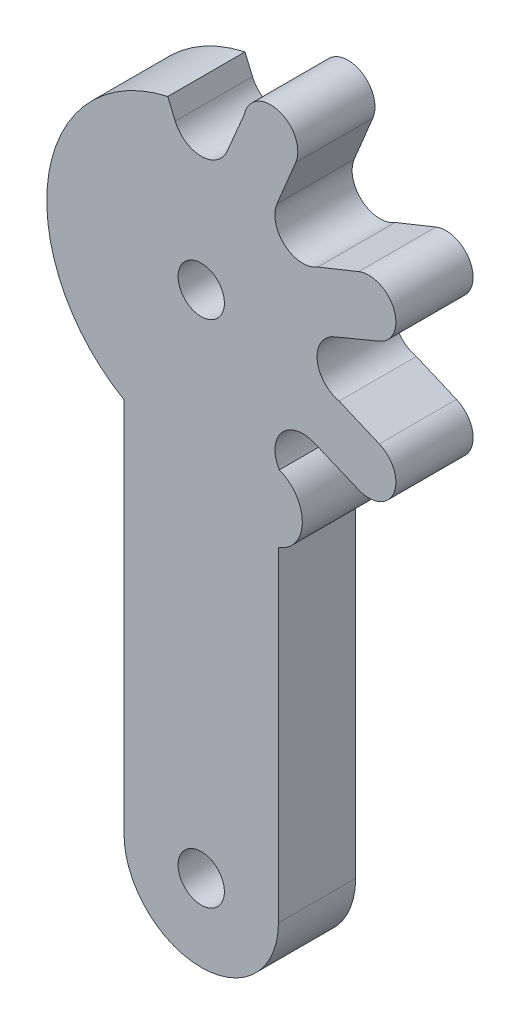
ISO-10303-21;
HEADER;
FILE_DESCRIPTION(('STEP AP214'),'2;1');
FILE_NAME('part.step','',(''),(''),'','','');
FILE_SCHEMA(('AUTOMOTIVE_DESIGN { 1 0 10303 214 1 1 1 1 }'));
ENDSEC;
DATA;
#1=APPLICATION_CONTEXT('core data for automotive mechanical design processes');
#2=APPLICATION_PROTOCOL_DEFINITION('international standard','automotive_design',2000,#1);
#3=PRODUCT_CONTEXT('',#1,'mechanical');
#4=PRODUCT('Part','Part','',(#3));
#5=PRODUCT_RELATED_PRODUCT_CATEGORY('part','',(#4));
#6=PRODUCT_DEFINITION_FORMATION('','',#4);
#7=PRODUCT_DEFINITION_CONTEXT('part definition',#1,'design');
#8=PRODUCT_DEFINITION('design','',#6,#7);
#9=PRODUCT_DEFINITION_SHAPE('','',#8);
#10=(LENGTH_UNIT() NAMED_UNIT(*) SI_UNIT(.MILLI.,.METRE.));
#11=(NAMED_UNIT(*) PLANE_ANGLE_UNIT() SI_UNIT($,.RADIAN.));
#12=(NAMED_UNIT(*) SI_UNIT($,.STERADIAN.) SOLID_ANGLE_UNIT());
#13=UNCERTAINTY_MEASURE_WITH_UNIT(LENGTH_MEASURE(1.E-05),#10,'distance_accuracy_value','');
#14=(GEOMETRIC_REPRESENTATION_CONTEXT(3) GLOBAL_UNCERTAINTY_ASSIGNED_CONTEXT((#13)) GLOBAL_UNIT_ASSIGNED_CONTEXT((#10,
#11,#12)) REPRESENTATION_CONTEXT('',''));
#15=CARTESIAN_POINT('',(0.,0.,0.));
#16=DIRECTION('',(0.,0.,1.));
#17=DIRECTION('',(1.,0.,0.));
#18=AXIS2_PLACEMENT_3D('',#15,#16,#17);
#19=CARTESIAN_POINT('',(4.99970649552399,4.44677047828112E-05,5.));
#20=DIRECTION('',(0.999999999960448,8.89406304567324E-06,0.));
#21=DIRECTION('',(-8.89406304567324E-06,0.999999999960448,0.));
#22=AXIS2_PLACEMENT_3D('',#19,#20,#21);
#23=PLANE('',#22);
#24=DIRECTION('',(8.89406304567324E-06,-0.999999999960448,0.));
#25=VECTOR('',#24,1.);
#26=CARTESIAN_POINT('',(4.99970649552399,4.44677047828112E-05,0.));
#27=LINE('',#26,#25);
#28=CARTESIAN_POINT('',(4.99981272260186,-11.9435495145082,0.));
#29=VERTEX_POINT('',#28);
#30=CARTESIAN_POINT('',(5.,-32.9999999990811,0.));
#31=VERTEX_POINT('',#30);
#32=EDGE_CURVE('E204',#29,#31,#27,.T.);
#33=ORIENTED_EDGE('',*,*,#32,.F.);
#34=DIRECTION('',(0.,0.,-1.));
#35=VECTOR('',#34,1.);
#36=CARTESIAN_POINT('',(4.99981272260186,-11.9435495145082,5.));
#37=LINE('',#36,#35);
#38=CARTESIAN_POINT('',(4.99981272260186,-11.9435495145082,5.));
#39=VERTEX_POINT('',#38);
#40=EDGE_CURVE('E11',#39,#29,#37,.T.);
#41=ORIENTED_EDGE('',*,*,#40,.F.);
#42=DIRECTION('',(8.89406304567324E-06,-0.999999999960448,0.));
#43=VECTOR('',#42,1.);
#44=CARTESIAN_POINT('',(4.99970649552399,4.44677047828112E-05,5.));
#45=LINE('',#44,#43);
#46=CARTESIAN_POINT('',(5.,-32.9999999990811,5.));
#47=VERTEX_POINT('',#46);
#48=EDGE_CURVE('E579',#39,#47,#45,.T.);
#49=ORIENTED_EDGE('',*,*,#48,.T.);
#50=DIRECTION('',(0.,0.,-1.));
#51=VECTOR('',#50,1.);
#52=CARTESIAN_POINT('',(5.,-32.9999999990811,5.));
#53=LINE('',#52,#51);
#54=EDGE_CURVE('E119',#47,#31,#53,.T.);
#55=ORIENTED_EDGE('',*,*,#54,.T.);
#56=EDGE_LOOP('',(#33,#41,#49,#55));
#57=FACE_BOUND('',#56,.T.);
#58=ADVANCED_FACE('F34',(#57),#23,.T.);
#59=CARTESIAN_POINT('',(4.20698218271208,-9.74206172722626,5.));
#60=DIRECTION('',(0.,0.,-1.));
#61=DIRECTION('',(-1.,0.,0.));
#62=AXIS2_PLACEMENT_3D('',#59,#60,#61);
#63=CYLINDRICAL_SURFACE('',#62,2.33989930179343);
#64=CARTESIAN_POINT('',(4.20698218271208,-9.74206172722626,0.));
#65=DIRECTION('',(0.,0.,1.));
#66=DIRECTION('',(1.,0.,0.));
#67=AXIS2_PLACEMENT_3D('',#64,#65,#66);
#68=CIRCLE('',#67,2.33989930179343);
#69=CARTESIAN_POINT('',(5.06067248823431,-7.56345171054344,0.));
#70=VERTEX_POINT('',#69);
#71=EDGE_CURVE('E206',#29,#70,#68,.T.);
#72=ORIENTED_EDGE('',*,*,#71,.T.);
#73=DIRECTION('',(0.,0.,-1.));
#74=VECTOR('',#73,1.);
#75=CARTESIAN_POINT('',(5.06067248823431,-7.56345171054344,5.));
#76=LINE('',#75,#74);
#77=CARTESIAN_POINT('',(5.06067248823431,-7.56345171054344,5.));
#78=VERTEX_POINT('',#77);
#79=EDGE_CURVE('E43',#78,#70,#76,.T.);
#80=ORIENTED_EDGE('',*,*,#79,.F.);
#81=CARTESIAN_POINT('',(4.20698218271208,-9.74206172722626,5.));
#82=DIRECTION('',(0.,0.,1.));
#83=DIRECTION('',(1.,0.,0.));
#84=AXIS2_PLACEMENT_3D('',#81,#82,#83);
#85=CIRCLE('',#84,2.33989930179343);
#86=EDGE_CURVE('E577',#39,#78,#85,.T.);
#87=ORIENTED_EDGE('',*,*,#86,.F.);
#88=ORIENTED_EDGE('',*,*,#40,.T.);
#89=EDGE_LOOP('',(#72,#80,#87,#88));
#90=FACE_BOUND('',#89,.T.);
#91=ADVANCED_FACE('F296',(#90),#63,.T.);
#92=CARTESIAN_POINT('',(6.58824723791817,-6.58419019165335,5.));
#93=DIRECTION('',(0.,0.,-1.));
#94=DIRECTION('',(-1.,0.,0.));
#95=AXIS2_PLACEMENT_3D('',#92,#93,#94);
#96=CYLINDRICAL_SURFACE('',#95,1.81450757459169);
#97=CARTESIAN_POINT('',(6.58824723791817,-6.58419019165335,0.));
#98=DIRECTION('',(0.,0.,1.));
#99=DIRECTION('',(1.,0.,0.));
#100=AXIS2_PLACEMENT_3D('',#97,#98,#99);
#101=CIRCLE('',#100,1.81450757459169);
#102=CARTESIAN_POINT('',(7.28281649303357,-4.90788136327504,0.));
#103=VERTEX_POINT('',#102);
#104=EDGE_CURVE('E209',#70,#103,#101,.F.);
#105=ORIENTED_EDGE('',*,*,#104,.T.);
#106=DIRECTION('',(0.,0.,-1.));
#107=VECTOR('',#106,1.);
#108=CARTESIAN_POINT('',(7.28281649303357,-4.90788136327504,5.));
#109=LINE('',#108,#107);
#110=CARTESIAN_POINT('',(7.28281649303357,-4.90788136327504,5.));
#111=VERTEX_POINT('',#110);
#112=EDGE_CURVE('E286',#111,#103,#109,.T.);
#113=ORIENTED_EDGE('',*,*,#112,.F.);
#114=CARTESIAN_POINT('',(6.58824723791817,-6.58419019165335,5.));
#115=DIRECTION('',(0.,0.,1.));
#116=DIRECTION('',(1.,0.,0.));
#117=AXIS2_PLACEMENT_3D('',#114,#115,#116);
#118=CIRCLE('',#117,1.81450757459169);
#119=EDGE_CURVE('E292',#78,#111,#118,.F.);
#120=ORIENTED_EDGE('',*,*,#119,.F.);
#121=ORIENTED_EDGE('',*,*,#79,.T.);
#122=EDGE_LOOP('',(#105,#113,#120,#121));
#123=FACE_BOUND('',#122,.T.);
#124=ADVANCED_FACE('F290',(#123),#96,.F.);
#125=CARTESIAN_POINT('',(-0.668654314279278,-1.61427431407232,5.));
#126=DIRECTION('',(-0.38268343236509,-0.923879532511287,0.));
#127=DIRECTION('',(0.923879532511287,-0.38268343236509,0.));
#128=AXIS2_PLACEMENT_3D('',#125,#126,#127);
#129=PLANE('',#128);
#130=DIRECTION('',(-0.923879532511287,0.38268343236509,0.));
#131=VECTOR('',#130,1.);
#132=CARTESIAN_POINT('',(-0.668654314279278,-1.61427431407232,0.));
#133=LINE('',#132,#131);
#134=CARTESIAN_POINT('',(10.1869299011087,-6.11080452356931,0.));
#135=VERTEX_POINT('',#134);
#136=EDGE_CURVE('E212',#135,#103,#133,.T.);
#137=ORIENTED_EDGE('',*,*,#136,.F.);
#138=DIRECTION('',(0.,0.,-1.));
#139=VECTOR('',#138,1.);
#140=CARTESIAN_POINT('',(10.1869299011087,-6.11080452356931,5.));
#141=LINE('',#140,#139);
#142=CARTESIAN_POINT('',(10.1869299011087,-6.11080452356931,5.));
#143=VERTEX_POINT('',#142);
#144=EDGE_CURVE('E284',#143,#135,#141,.T.);
#145=ORIENTED_EDGE('',*,*,#144,.F.);
#146=DIRECTION('',(-0.923879532511287,0.38268343236509,0.));
#147=VECTOR('',#146,1.);
#148=CARTESIAN_POINT('',(-0.668654314279278,-1.61427431407232,5.));
#149=LINE('',#148,#147);
#150=EDGE_CURVE('E530',#143,#111,#149,.T.);
#151=ORIENTED_EDGE('',*,*,#150,.T.);
#152=ORIENTED_EDGE('',*,*,#112,.T.);
#153=EDGE_LOOP('',(#137,#145,#151,#152));
#154=FACE_BOUND('',#153,.T.);
#155=ADVANCED_FACE('F382',(#154),#129,.T.);
#156=CARTESIAN_POINT('',(10.856438621682,-4.49393779066091,5.));
#157=DIRECTION('',(0.,0.,-1.));
#158=DIRECTION('',(-1.,0.,0.));
#159=AXIS2_PLACEMENT_3D('',#156,#157,#158);
#160=CYLINDRICAL_SURFACE('',#159,1.74999998825991);
#161=CARTESIAN_POINT('',(10.856438621682,-4.49393779066091,0.));
#162=DIRECTION('',(0.,0.,1.));
#163=DIRECTION('',(1.,0.,0.));
#164=AXIS2_PLACEMENT_3D('',#161,#162,#163);
#165=CIRCLE('',#164,1.74999998825991);
#166=CARTESIAN_POINT('',(11.5259473419372,-2.87707105762073,0.));
#167=VERTEX_POINT('',#166);
#168=EDGE_CURVE('E215',#167,#135,#165,.F.);
#169=ORIENTED_EDGE('',*,*,#168,.F.);
#170=DIRECTION('',(0.,0.,-1.));
#171=VECTOR('',#170,1.);
#172=CARTESIAN_POINT('',(11.5259473419372,-2.87707105762073,5.));
#173=LINE('',#172,#171);
#174=CARTESIAN_POINT('',(11.5259473419372,-2.87707105762073,5.));
#175=VERTEX_POINT('',#174);
#176=EDGE_CURVE('E282',#175,#167,#173,.T.);
#177=ORIENTED_EDGE('',*,*,#176,.F.);
#178=CARTESIAN_POINT('',(10.856438621682,-4.49393779066091,5.));
#179=DIRECTION('',(0.,0.,1.));
#180=DIRECTION('',(1.,0.,0.));
#181=AXIS2_PLACEMENT_3D('',#178,#179,#180);
#182=CIRCLE('',#181,1.74999998825991);
#183=EDGE_CURVE('E527',#175,#143,#182,.F.);
#184=ORIENTED_EDGE('',*,*,#183,.T.);
#185=ORIENTED_EDGE('',*,*,#144,.T.);
#186=EDGE_LOOP('',(#169,#177,#184,#185));
#187=FACE_BOUND('',#186,.T.);
#188=ADVANCED_FACE('F378',(#187),#160,.T.);
#189=CARTESIAN_POINT('',(0.733386196101343,1.72129038927206,5.));
#190=DIRECTION('',(-0.391972444476687,-0.919976957739144,0.));
#191=DIRECTION('',(0.919976957739144,-0.391972444476687,0.));
#192=AXIS2_PLACEMENT_3D('',#189,#190,#191);
#193=PLANE('',#192);
#194=DIRECTION('',(-0.919976957739144,0.391972444476687,0.));
#195=VECTOR('',#194,1.);
#196=CARTESIAN_POINT('',(0.733386196101343,1.72129038927206,0.));
#197=LINE('',#196,#195);
#198=CARTESIAN_POINT('',(8.9267911025669,-1.76965459881451,0.));
#199=VERTEX_POINT('',#198);
#200=EDGE_CURVE('E218',#167,#199,#197,.T.);
#201=ORIENTED_EDGE('',*,*,#200,.T.);
#202=DIRECTION('',(0.,0.,-1.));
#203=VECTOR('',#202,1.);
#204=CARTESIAN_POINT('',(8.9267911025669,-1.76965459881451,5.));
#205=LINE('',#204,#203);
#206=CARTESIAN_POINT('',(8.9267911025669,-1.76965459881451,5.));
#207=VERTEX_POINT('',#206);
#208=EDGE_CURVE('E279',#207,#199,#205,.T.);
#209=ORIENTED_EDGE('',*,*,#208,.F.);
#210=DIRECTION('',(-0.919976957739144,0.391972444476687,0.));
#211=VECTOR('',#210,1.);
#212=CARTESIAN_POINT('',(0.733386196101343,1.72129038927206,5.));
#213=LINE('',#212,#211);
#214=EDGE_CURVE('E529',#175,#207,#213,.T.);
#215=ORIENTED_EDGE('',*,*,#214,.F.);
#216=ORIENTED_EDGE('',*,*,#176,.T.);
#217=EDGE_LOOP('',(#201,#209,#215,#216));
#218=FACE_BOUND('',#217,.T.);
#219=ADVANCED_FACE('F374',(#218),#193,.F.);
#220=CARTESIAN_POINT('',(9.31450710860851,0.00294632550811113,5.));
#221=DIRECTION('',(0.,0.,-1.));
#222=DIRECTION('',(-1.,0.,0.));
#223=AXIS2_PLACEMENT_3D('',#220,#221,#222);
#224=CYLINDRICAL_SURFACE('',#223,1.8145075745917);
#225=CARTESIAN_POINT('',(9.31450710860851,0.00294632550811113,0.));
#226=DIRECTION('',(0.,0.,1.));
#227=DIRECTION('',(1.,0.,0.));
#228=AXIS2_PLACEMENT_3D('',#225,#226,#227);
#229=CIRCLE('',#228,1.8145075745917);
#230=CARTESIAN_POINT('',(8.62012593661054,1.67933307271944,0.));
#231=VERTEX_POINT('',#230);
#232=EDGE_CURVE('E221',#199,#231,#229,.F.);
#233=ORIENTED_EDGE('',*,*,#232,.T.);
#234=DIRECTION('',(0.,0.,-1.));
#235=VECTOR('',#234,1.);
#236=CARTESIAN_POINT('',(8.62012593661054,1.67933307271944,5.));
#237=LINE('',#236,#235);
#238=CARTESIAN_POINT('',(8.62012593661054,1.67933307271944,5.));
#239=VERTEX_POINT('',#238);
#240=EDGE_CURVE('E277',#239,#231,#237,.T.);
#241=ORIENTED_EDGE('',*,*,#240,.F.);
#242=CARTESIAN_POINT('',(9.31450710860851,0.00294632550811113,5.));
#243=DIRECTION('',(0.,0.,1.));
#244=DIRECTION('',(1.,0.,0.));
#245=AXIS2_PLACEMENT_3D('',#242,#243,#244);
#246=CIRCLE('',#245,1.8145075745917);
#247=EDGE_CURVE('E532',#207,#239,#246,.F.);
#248=ORIENTED_EDGE('',*,*,#247,.F.);
#249=ORIENTED_EDGE('',*,*,#208,.T.);
#250=EDGE_LOOP('',(#233,#241,#248,#249));
#251=FACE_BOUND('',#250,.T.);
#252=ADVANCED_FACE('F370',(#251),#224,.F.);
#253=CARTESIAN_POINT('',(0.668654314278487,-1.61427431407202,5.));
#254=DIRECTION('',(0.382683432364764,-0.923879532511422,0.));
#255=DIRECTION('',(0.923879532511422,0.382683432364764,0.));
#256=AXIS2_PLACEMENT_3D('',#253,#254,#255);
#257=PLANE('',#256);
#258=DIRECTION('',(-0.923879532511422,-0.382683432364764,0.));
#259=VECTOR('',#258,1.);
#260=CARTESIAN_POINT('',(0.668654314278487,-1.61427431407202,0.));
#261=LINE('',#260,#259);
#262=CARTESIAN_POINT('',(11.5242393446861,2.88225623301268,0.));
#263=VERTEX_POINT('',#262);
#264=EDGE_CURVE('E224',#263,#231,#261,.T.);
#265=ORIENTED_EDGE('',*,*,#264,.F.);
#266=DIRECTION('',(0.,0.,-1.));
#267=VECTOR('',#266,1.);
#268=CARTESIAN_POINT('',(11.5242393446861,2.88225623301268,5.));
#269=LINE('',#268,#267);
#270=CARTESIAN_POINT('',(11.5242393446861,2.88225623301268,5.));
#271=VERTEX_POINT('',#270);
#272=EDGE_CURVE('E275',#271,#263,#269,.T.);
#273=ORIENTED_EDGE('',*,*,#272,.F.);
#274=DIRECTION('',(-0.923879532511422,-0.382683432364764,0.));
#275=VECTOR('',#274,1.);
#276=CARTESIAN_POINT('',(0.668654314278487,-1.61427431407202,5.));
#277=LINE('',#276,#275);
#278=EDGE_CURVE('E538',#271,#239,#277,.T.);
#279=ORIENTED_EDGE('',*,*,#278,.T.);
#280=ORIENTED_EDGE('',*,*,#240,.T.);
#281=EDGE_LOOP('',(#265,#273,#279,#280));
#282=FACE_BOUND('',#281,.T.);
#283=ADVANCED_FACE('F366',(#282),#257,.T.);
#284=CARTESIAN_POINT('',(10.8545425233484,4.49904507744921,5.));
#285=DIRECTION('',(0.,0.,-1.));
#286=DIRECTION('',(-1.,0.,0.));
#287=AXIS2_PLACEMENT_3D('',#284,#285,#286);
#288=CYLINDRICAL_SURFACE('',#287,1.75000000000123);
#289=CARTESIAN_POINT('',(10.8545425233484,4.49904507744921,0.));
#290=DIRECTION('',(0.,0.,1.));
#291=DIRECTION('',(1.,0.,0.));
#292=AXIS2_PLACEMENT_3D('',#289,#290,#291);
#293=CIRCLE('',#292,1.75000000000123);
#294=CARTESIAN_POINT('',(10.1844719798856,6.11567907028367,0.));
#295=VERTEX_POINT('',#294);
#296=EDGE_CURVE('E227',#295,#263,#293,.F.);
#297=ORIENTED_EDGE('',*,*,#296,.F.);
#298=DIRECTION('',(0.,0.,-1.));
#299=VECTOR('',#298,1.);
#300=CARTESIAN_POINT('',(10.1844719798856,6.11567907028367,5.));
#301=LINE('',#300,#299);
#302=CARTESIAN_POINT('',(10.1844719798856,6.11567907028367,5.));
#303=VERTEX_POINT('',#302);
#304=EDGE_CURVE('E273',#303,#295,#301,.T.);
#305=ORIENTED_EDGE('',*,*,#304,.F.);
#306=CARTESIAN_POINT('',(10.8545425233484,4.49904507744921,5.));
#307=DIRECTION('',(0.,0.,1.));
#308=DIRECTION('',(1.,0.,0.));
#309=AXIS2_PLACEMENT_3D('',#306,#307,#308);
#310=CIRCLE('',#309,1.75000000000123);
#311=EDGE_CURVE('E541',#303,#271,#310,.F.);
#312=ORIENTED_EDGE('',*,*,#311,.T.);
#313=ORIENTED_EDGE('',*,*,#272,.T.);
#314=EDGE_LOOP('',(#297,#305,#312,#313));
#315=FACE_BOUND('',#314,.T.);
#316=ADVANCED_FACE('F362',(#315),#288,.T.);
#317=CARTESIAN_POINT('',(-0.69855375415384,1.73571845913922,5.));
#318=DIRECTION('',(0.373355571824736,-0.927688318880552,0.));
#319=DIRECTION('',(0.927688318880552,0.373355571824736,0.));
#320=AXIS2_PLACEMENT_3D('',#317,#318,#319);
#321=PLANE('',#320);
#322=DIRECTION('',(-0.927688318880552,-0.373355571824736,0.));
#323=VECTOR('',#322,1.);
#324=CARTESIAN_POINT('',(-0.69855375415384,1.73571845913922,0.));
#325=LINE('',#324,#323);
#326=CARTESIAN_POINT('',(7.56352929004419,5.06085975568194,0.));
#327=VERTEX_POINT('',#326);
#328=EDGE_CURVE('E230',#295,#327,#325,.T.);
#329=ORIENTED_EDGE('',*,*,#328,.T.);
#330=DIRECTION('',(0.,0.,-1.));
#331=VECTOR('',#330,1.);
#332=CARTESIAN_POINT('',(7.56352929004419,5.06085975568194,5.));
#333=LINE('',#332,#331);
#334=CARTESIAN_POINT('',(7.56352929004419,5.06085975568194,5.));
#335=VERTEX_POINT('',#334);
#336=EDGE_CURVE('E270',#335,#327,#333,.T.);
#337=ORIENTED_EDGE('',*,*,#336,.F.);
#338=DIRECTION('',(-0.927688318880552,-0.373355571824736,0.));
#339=VECTOR('',#338,1.);
#340=CARTESIAN_POINT('',(-0.69855375415384,1.73571845913922,5.));
#341=LINE('',#340,#339);
#342=EDGE_CURVE('E544',#303,#335,#341,.T.);
#343=ORIENTED_EDGE('',*,*,#342,.F.);
#344=ORIENTED_EDGE('',*,*,#304,.T.);
#345=EDGE_LOOP('',(#329,#337,#343,#344));
#346=FACE_BOUND('',#345,.T.);
#347=ADVANCED_FACE('F358',(#346),#321,.F.);
#348=CARTESIAN_POINT('',(6.58426777316243,6.58843450665181,5.));
#349=DIRECTION('',(0.,0.,-1.));
#350=DIRECTION('',(-1.,0.,0.));
#351=AXIS2_PLACEMENT_3D('',#348,#349,#350);
#352=CYLINDRICAL_SURFACE('',#351,1.81450757459083);
#353=CARTESIAN_POINT('',(6.58426777316243,6.58843450665181,0.));
#354=DIRECTION('',(0.,0.,1.));
#355=DIRECTION('',(1.,0.,0.));
#356=AXIS2_PLACEMENT_3D('',#353,#354,#355);
#357=CIRCLE('',#356,1.81450757459083);
#358=CARTESIAN_POINT('',(4.90788136340853,7.28281649334303,0.));
#359=VERTEX_POINT('',#358);
#360=EDGE_CURVE('E233',#327,#359,#357,.F.);
#361=ORIENTED_EDGE('',*,*,#360,.T.);
#362=DIRECTION('',(0.,0.,-1.));
#363=VECTOR('',#362,1.);
#364=CARTESIAN_POINT('',(4.90788136340853,7.28281649334303,5.));
#365=LINE('',#364,#363);
#366=CARTESIAN_POINT('',(4.90788136340853,7.28281649334303,5.));
#367=VERTEX_POINT('',#366);
#368=EDGE_CURVE('E268',#367,#359,#365,.T.);
#369=ORIENTED_EDGE('',*,*,#368,.F.);
#370=CARTESIAN_POINT('',(6.58426777316243,6.58843450665181,5.));
#371=DIRECTION('',(0.,0.,1.));
#372=DIRECTION('',(1.,0.,0.));
#373=AXIS2_PLACEMENT_3D('',#370,#371,#372);
#374=CIRCLE('',#373,1.81450757459083);
#375=EDGE_CURVE('E547',#335,#367,#374,.F.);
#376=ORIENTED_EDGE('',*,*,#375,.F.);
#377=ORIENTED_EDGE('',*,*,#336,.T.);
#378=EDGE_LOOP('',(#361,#369,#376,#377));
#379=FACE_BOUND('',#378,.T.);
#380=ADVANCED_FACE('F354',(#379),#352,.F.);
#381=CARTESIAN_POINT('',(1.61427431407685,-0.668654314281156,5.));
#382=DIRECTION('',(0.923879532511287,-0.38268343236509,0.));
#383=DIRECTION('',(0.38268343236509,0.923879532511287,0.));
#384=AXIS2_PLACEMENT_3D('',#381,#382,#383);
#385=PLANE('',#384);
#386=DIRECTION('',(-0.38268343236509,-0.923879532511287,0.));
#387=VECTOR('',#386,1.);
#388=CARTESIAN_POINT('',(1.61427431407685,-0.668654314281156,0.));
#389=LINE('',#388,#387);
#390=CARTESIAN_POINT('',(6.11080452370281,10.1869299014182,0.));
#391=VERTEX_POINT('',#390);
#392=EDGE_CURVE('E236',#391,#359,#389,.T.);
#393=ORIENTED_EDGE('',*,*,#392,.F.);
#394=DIRECTION('',(0.,0.,-1.));
#395=VECTOR('',#394,1.);
#396=CARTESIAN_POINT('',(6.11080452370281,10.1869299014182,5.));
#397=LINE('',#396,#395);
#398=CARTESIAN_POINT('',(6.11080452370281,10.1869299014182,5.));
#399=VERTEX_POINT('',#398);
#400=EDGE_CURVE('E266',#399,#391,#397,.T.);
#401=ORIENTED_EDGE('',*,*,#400,.F.);
#402=DIRECTION('',(-0.38268343236509,-0.923879532511287,0.));
#403=VECTOR('',#402,1.);
#404=CARTESIAN_POINT('',(1.61427431407685,-0.668654314281156,5.));
#405=LINE('',#404,#403);
#406=EDGE_CURVE('E549',#399,#367,#405,.T.);
#407=ORIENTED_EDGE('',*,*,#406,.T.);
#408=ORIENTED_EDGE('',*,*,#368,.T.);
#409=EDGE_LOOP('',(#393,#401,#407,#408));
#410=FACE_BOUND('',#409,.T.);
#411=ADVANCED_FACE('F350',(#410),#385,.T.);
#412=CARTESIAN_POINT('',(4.50324603956486,10.8784902531421,5.));
#413=DIRECTION('',(0.,0.,-1.));
#414=DIRECTION('',(-1.,0.,0.));
#415=AXIS2_PLACEMENT_3D('',#412,#413,#414);
#416=CYLINDRICAL_SURFACE('',#415,1.75000000000008);
#417=CARTESIAN_POINT('',(4.50324603956486,10.8784902531421,0.));
#418=DIRECTION('',(0.,0.,1.));
#419=DIRECTION('',(1.,0.,0.));
#420=AXIS2_PLACEMENT_3D('',#417,#418,#419);
#421=CIRCLE('',#420,1.75000000000008);
#422=CARTESIAN_POINT('',(2.78674919406376,11.2192813612786,0.));
#423=VERTEX_POINT('',#422);
#424=EDGE_CURVE('E239',#423,#391,#421,.F.);
#425=ORIENTED_EDGE('',*,*,#424,.F.);
#426=DIRECTION('',(0.,0.,-1.));
#427=VECTOR('',#426,1.);
#428=CARTESIAN_POINT('',(2.78674919406376,11.2192813612786,5.));
#429=LINE('',#428,#427);
#430=CARTESIAN_POINT('',(2.78674919406376,11.2192813612786,5.));
#431=VERTEX_POINT('',#430);
#432=EDGE_CURVE('E264',#431,#423,#429,.T.);
#433=ORIENTED_EDGE('',*,*,#432,.F.);
#434=CARTESIAN_POINT('',(4.50324603956486,10.8784902531421,5.));
#435=DIRECTION('',(0.,0.,1.));
#436=DIRECTION('',(1.,0.,0.));
#437=AXIS2_PLACEMENT_3D('',#434,#435,#436);
#438=CIRCLE('',#437,1.75000000000008);
#439=EDGE_CURVE('E552',#431,#399,#438,.F.);
#440=ORIENTED_EDGE('',*,*,#439,.T.);
#441=ORIENTED_EDGE('',*,*,#400,.T.);
#442=EDGE_LOOP('',(#425,#433,#440,#441));
#443=FACE_BOUND('',#442,.T.);
#444=ADVANCED_FACE('F346',(#443),#416,.T.);
#445=CARTESIAN_POINT('',(-1.68714951003195,0.718839871023794,5.));
#446=DIRECTION('',(0.919976957738887,-0.391972444477289,0.));
#447=DIRECTION('',(0.391972444477289,0.919976957738887,0.));
#448=AXIS2_PLACEMENT_3D('',#445,#446,#447);
#449=PLANE('',#448);
#450=DIRECTION('',(-0.391972444477289,-0.919976957738887,0.));
#451=VECTOR('',#450,1.);
#452=CARTESIAN_POINT('',(-1.68714951003195,0.718839871023794,0.));
#453=LINE('',#452,#451);
#454=CARTESIAN_POINT('',(1.67933273525604,8.62012512190951,0.));
#455=VERTEX_POINT('',#454);
#456=EDGE_CURVE('E242',#423,#455,#453,.T.);
#457=ORIENTED_EDGE('',*,*,#456,.T.);
#458=DIRECTION('',(0.,0.,-1.));
#459=VECTOR('',#458,1.);
#460=CARTESIAN_POINT('',(1.67933273525604,8.62012512190951,5.));
#461=LINE('',#460,#459);
#462=CARTESIAN_POINT('',(1.67933273525604,8.62012512190951,5.));
#463=VERTEX_POINT('',#462);
#464=EDGE_CURVE('E261',#463,#455,#461,.T.);
#465=ORIENTED_EDGE('',*,*,#464,.F.);
#466=DIRECTION('',(-0.391972444477289,-0.919976957738887,0.));
#467=VECTOR('',#466,1.);
#468=CARTESIAN_POINT('',(-1.68714951003195,0.718839871023794,5.));
#469=LINE('',#468,#467);
#470=EDGE_CURVE('E555',#431,#463,#469,.T.);
#471=ORIENTED_EDGE('',*,*,#470,.F.);
#472=ORIENTED_EDGE('',*,*,#432,.T.);
#473=EDGE_LOOP('',(#457,#465,#471,#472));
#474=FACE_BOUND('',#473,.T.);
#475=ADVANCED_FACE('F342',(#474),#449,.F.);
#476=CARTESIAN_POINT('',(0.,9.30735092362625,5.));
#477=DIRECTION('',(0.,0.,-1.));
#478=DIRECTION('',(-1.,0.,0.));
#479=AXIS2_PLACEMENT_3D('',#476,#477,#478);
#480=CYLINDRICAL_SURFACE('',#479,1.8145075745909);
#481=CARTESIAN_POINT('',(0.,9.30735092362625,0.));
#482=DIRECTION('',(0.,0.,1.));
#483=DIRECTION('',(1.,0.,0.));
#484=AXIS2_PLACEMENT_3D('',#481,#482,#483);
#485=CIRCLE('',#484,1.8145075745909);
#486=CARTESIAN_POINT('',(-1.67933273525604,8.62012512190951,0.));
#487=VERTEX_POINT('',#486);
#488=EDGE_CURVE('E245',#455,#487,#485,.F.);
#489=ORIENTED_EDGE('',*,*,#488,.T.);
#490=DIRECTION('',(0.,0.,-1.));
#491=VECTOR('',#490,1.);
#492=CARTESIAN_POINT('',(-1.67933273525604,8.62012512190951,5.));
#493=LINE('',#492,#491);
#494=CARTESIAN_POINT('',(-1.67933273525604,8.62012512190951,5.));
#495=VERTEX_POINT('',#494);
#496=EDGE_CURVE('E259',#495,#487,#493,.T.);
#497=ORIENTED_EDGE('',*,*,#496,.F.);
#498=CARTESIAN_POINT('',(0.,9.30735092362625,5.));
#499=DIRECTION('',(0.,0.,1.));
#500=DIRECTION('',(1.,0.,0.));
#501=AXIS2_PLACEMENT_3D('',#498,#499,#500);
#502=CIRCLE('',#501,1.8145075745909);
#503=EDGE_CURVE('E193',#463,#495,#502,.F.);
#504=ORIENTED_EDGE('',*,*,#503,.F.);
#505=ORIENTED_EDGE('',*,*,#464,.T.);
#506=EDGE_LOOP('',(#489,#497,#504,#505));
#507=FACE_BOUND('',#506,.T.);
#508=ADVANCED_FACE('F338',(#507),#480,.F.);
#509=CARTESIAN_POINT('',(1.68714951003195,0.718839871023795,5.));
#510=DIRECTION('',(0.919976957738887,0.39197244447729,0.));
#511=DIRECTION('',(-0.39197244447729,0.919976957738887,0.));
#512=AXIS2_PLACEMENT_3D('',#509,#510,#511);
#513=PLANE('',#512);
#514=DIRECTION('',(0.39197244447729,-0.919976957738887,0.));
#515=VECTOR('',#514,1.);
#516=CARTESIAN_POINT('',(1.68714951003195,0.718839871023795,0.));
#517=LINE('',#516,#515);
#518=CARTESIAN_POINT('',(-2.16609703837059,9.76258283551839,0.));
#519=VERTEX_POINT('',#518);
#520=EDGE_CURVE('E248',#519,#487,#517,.T.);
#521=ORIENTED_EDGE('',*,*,#520,.F.);
#522=DIRECTION('',(0.,0.,-1.));
#523=VECTOR('',#522,1.);
#524=CARTESIAN_POINT('',(-2.16609703837059,9.76258283551839,5.));
#525=LINE('',#524,#523);
#526=CARTESIAN_POINT('',(-2.16609703837059,9.76258283551839,5.));
#527=VERTEX_POINT('',#526);
#528=EDGE_CURVE('E181',#527,#519,#525,.T.);
#529=ORIENTED_EDGE('',*,*,#528,.F.);
#530=DIRECTION('',(0.39197244447729,-0.919976957738887,0.));
#531=VECTOR('',#530,1.);
#532=CARTESIAN_POINT('',(1.68714951003195,0.718839871023795,5.));
#533=LINE('',#532,#531);
#534=EDGE_CURVE('E191',#527,#495,#533,.T.);
#535=ORIENTED_EDGE('',*,*,#534,.T.);
#536=ORIENTED_EDGE('',*,*,#496,.T.);
#537=EDGE_LOOP('',(#521,#529,#535,#536));
#538=FACE_BOUND('',#537,.T.);
#539=ADVANCED_FACE('F335',(#538),#513,.T.);
#540=CARTESIAN_POINT('',(0.,0.,5.));
#541=DIRECTION('',(0.,0.,-1.));
#542=DIRECTION('',(-1.,0.,0.));
#543=AXIS2_PLACEMENT_3D('',#540,#541,#542);
#544=CYLINDRICAL_SURFACE('',#543,9.9999999999999);
#545=CARTESIAN_POINT('',(0.,0.,0.));
#546=DIRECTION('',(0.,0.,1.));
#547=DIRECTION('',(1.,0.,0.));
#548=AXIS2_PLACEMENT_3D('',#545,#546,#547);
#549=CIRCLE('',#548,9.9999999999999);
#550=CARTESIAN_POINT('',(-5.,-8.66025403784439,0.));
#551=VERTEX_POINT('',#550);
#552=EDGE_CURVE('E178',#551,#519,#549,.F.);
#553=ORIENTED_EDGE('',*,*,#552,.F.);
#554=DIRECTION('',(0.,0.,-1.));
#555=VECTOR('',#554,1.);
#556=CARTESIAN_POINT('',(-5.,-8.66025403784439,5.));
#557=LINE('',#556,#555);
#558=CARTESIAN_POINT('',(-5.,-8.66025403784439,5.));
#559=VERTEX_POINT('',#558);
#560=EDGE_CURVE('E172',#559,#551,#557,.T.);
#561=ORIENTED_EDGE('',*,*,#560,.F.);
#562=CARTESIAN_POINT('',(0.,0.,5.));
#563=DIRECTION('',(0.,0.,1.));
#564=DIRECTION('',(1.,0.,0.));
#565=AXIS2_PLACEMENT_3D('',#562,#563,#564);
#566=CIRCLE('',#565,9.9999999999999);
#567=EDGE_CURVE('E176',#559,#527,#566,.F.);
#568=ORIENTED_EDGE('',*,*,#567,.T.);
#569=ORIENTED_EDGE('',*,*,#528,.T.);
#570=EDGE_LOOP('',(#553,#561,#568,#569));
#571=FACE_BOUND('',#570,.T.);
#572=ADVANCED_FACE('F174',(#571),#544,.T.);
#573=CARTESIAN_POINT('',(-5.,0.,5.));
#574=DIRECTION('',(1.,0.,0.));
#575=DIRECTION('',(0.,0.,-1.));
#576=AXIS2_PLACEMENT_3D('',#573,#574,#575);
#577=PLANE('',#576);
#578=DIRECTION('',(0.,-1.,0.));
#579=VECTOR('',#578,1.);
#580=CARTESIAN_POINT('',(-5.,0.,0.));
#581=LINE('',#580,#579);
#582=CARTESIAN_POINT('',(-5.,-33.,0.));
#583=VERTEX_POINT('',#582);
#584=EDGE_CURVE('E252',#551,#583,#581,.T.);
#585=ORIENTED_EDGE('',*,*,#584,.T.);
#586=DIRECTION('',(0.,0.,-1.));
#587=VECTOR('',#586,1.);
#588=CARTESIAN_POINT('',(-5.,-33.,5.));
#589=LINE('',#588,#587);
#590=CARTESIAN_POINT('',(-5.,-33.,5.));
#591=VERTEX_POINT('',#590);
#592=EDGE_CURVE('E182',#591,#583,#589,.T.);
#593=ORIENTED_EDGE('',*,*,#592,.F.);
#594=DIRECTION('',(0.,-1.,0.));
#595=VECTOR('',#594,1.);
#596=CARTESIAN_POINT('',(-5.,0.,5.));
#597=LINE('',#596,#595);
#598=EDGE_CURVE('E185',#559,#591,#597,.T.);
#599=ORIENTED_EDGE('',*,*,#598,.F.);
#600=ORIENTED_EDGE('',*,*,#560,.T.);
#601=EDGE_LOOP('',(#585,#593,#599,#600));
#602=FACE_BOUND('',#601,.T.);
#603=ADVANCED_FACE('F186',(#602),#577,.F.);
#604=CARTESIAN_POINT('',(0.,0.,5.));
#605=DIRECTION('',(0.,0.,-1.));
#606=DIRECTION('',(-1.,0.,0.));
#607=AXIS2_PLACEMENT_3D('',#604,#605,#606);
#608=CYLINDRICAL_SURFACE('',#607,1.5);
#609=CARTESIAN_POINT('',(0.,0.,5.));
#610=DIRECTION('',(0.,0.,1.));
#611=DIRECTION('',(1.,0.,0.));
#612=AXIS2_PLACEMENT_3D('',#609,#610,#611);
#613=CIRCLE('',#612,1.5);
#614=CARTESIAN_POINT('',(1.5,0.,5.));
#615=VERTEX_POINT('',#614);
#616=EDGE_CURVE('E318',#615,#615,#613,.T.);
#617=ORIENTED_EDGE('',*,*,#616,.T.);
#618=EDGE_LOOP('',(#617));
#619=FACE_BOUND('',#618,.T.);
#620=CARTESIAN_POINT('',(0.,0.,0.));
#621=DIRECTION('',(0.,0.,1.));
#622=DIRECTION('',(1.,0.,0.));
#623=AXIS2_PLACEMENT_3D('',#620,#621,#622);
#624=CIRCLE('',#623,1.5);
#625=CARTESIAN_POINT('',(1.5,0.,0.));
#626=VERTEX_POINT('',#625);
#627=EDGE_CURVE('E201',#626,#626,#624,.T.);
#628=ORIENTED_EDGE('',*,*,#627,.F.);
#629=EDGE_LOOP('',(#628));
#630=FACE_BOUND('',#629,.T.);
#631=ADVANCED_FACE('F305',(#619,#630),#608,.F.);
#632=CARTESIAN_POINT('',(0.,-33.,5.));
#633=DIRECTION('',(0.,0.,-1.));
#634=DIRECTION('',(-1.,0.,0.));
#635=AXIS2_PLACEMENT_3D('',#632,#633,#634);
#636=CYLINDRICAL_SURFACE('',#635,1.5);
#637=CARTESIAN_POINT('',(0.,-33.,5.));
#638=DIRECTION('',(0.,0.,1.));
#639=DIRECTION('',(1.,0.,0.));
#640=AXIS2_PLACEMENT_3D('',#637,#638,#639);
#641=CIRCLE('',#640,1.5);
#642=CARTESIAN_POINT('',(1.5,-33.,5.));
#643=VERTEX_POINT('',#642);
#644=EDGE_CURVE('E255',#643,#643,#641,.T.);
#645=ORIENTED_EDGE('',*,*,#644,.T.);
#646=EDGE_LOOP('',(#645));
#647=FACE_BOUND('',#646,.T.);
#648=CARTESIAN_POINT('',(0.,-33.,0.));
#649=DIRECTION('',(0.,0.,1.));
#650=DIRECTION('',(1.,0.,0.));
#651=AXIS2_PLACEMENT_3D('',#648,#649,#650);
#652=CIRCLE('',#651,1.5);
#653=CARTESIAN_POINT('',(1.5,-33.,0.));
#654=VERTEX_POINT('',#653);
#655=EDGE_CURVE('E198',#654,#654,#652,.T.);
#656=ORIENTED_EDGE('',*,*,#655,.F.);
#657=EDGE_LOOP('',(#656));
#658=FACE_BOUND('',#657,.T.);
#659=ADVANCED_FACE('F36',(#647,#658),#636,.F.);
#660=CARTESIAN_POINT('',(0.,-33.,5.));
#661=DIRECTION('',(0.,0.,-1.));
#662=DIRECTION('',(-1.,0.,0.));
#663=AXIS2_PLACEMENT_3D('',#660,#661,#662);
#664=CYLINDRICAL_SURFACE('',#663,5.);
#665=CARTESIAN_POINT('',(0.,-33.,0.));
#666=DIRECTION('',(0.,0.,1.));
#667=DIRECTION('',(1.,0.,0.));
#668=AXIS2_PLACEMENT_3D('',#665,#666,#667);
#669=CIRCLE('',#668,5.);
#670=EDGE_CURVE('E112',#583,#31,#669,.T.);
#671=ORIENTED_EDGE('',*,*,#670,.T.);
#672=ORIENTED_EDGE('',*,*,#54,.F.);
#673=CARTESIAN_POINT('',(0.,-33.,5.));
#674=DIRECTION('',(0.,0.,1.));
#675=DIRECTION('',(1.,0.,0.));
#676=AXIS2_PLACEMENT_3D('',#673,#674,#675);
#677=CIRCLE('',#676,5.);
#678=EDGE_CURVE('E51',#591,#47,#677,.T.);
#679=ORIENTED_EDGE('',*,*,#678,.F.);
#680=ORIENTED_EDGE('',*,*,#592,.T.);
#681=EDGE_LOOP('',(#671,#672,#679,#680));
#682=FACE_BOUND('',#681,.T.);
#683=ADVANCED_FACE('F312',(#682),#664,.T.);
#684=CARTESIAN_POINT('',(0.,0.,5.));
#685=DIRECTION('',(0.,0.,1.));
#686=DIRECTION('',(1.,0.,0.));
#687=AXIS2_PLACEMENT_3D('',#684,#685,#686);
#688=PLANE('',#687);
#689=ORIENTED_EDGE('',*,*,#644,.F.);
#690=EDGE_LOOP('',(#689));
#691=FACE_BOUND('',#690,.T.);
#692=ORIENTED_EDGE('',*,*,#616,.F.);
#693=EDGE_LOOP('',(#692));
#694=FACE_BOUND('',#693,.T.);
#695=ORIENTED_EDGE('',*,*,#48,.F.);
#696=ORIENTED_EDGE('',*,*,#86,.T.);
#697=ORIENTED_EDGE('',*,*,#119,.T.);
#698=ORIENTED_EDGE('',*,*,#150,.F.);
#699=ORIENTED_EDGE('',*,*,#183,.F.);
#700=ORIENTED_EDGE('',*,*,#214,.T.);
#701=ORIENTED_EDGE('',*,*,#247,.T.);
#702=ORIENTED_EDGE('',*,*,#278,.F.);
#703=ORIENTED_EDGE('',*,*,#311,.F.);
#704=ORIENTED_EDGE('',*,*,#342,.T.);
#705=ORIENTED_EDGE('',*,*,#375,.T.);
#706=ORIENTED_EDGE('',*,*,#406,.F.);
#707=ORIENTED_EDGE('',*,*,#439,.F.);
#708=ORIENTED_EDGE('',*,*,#470,.T.);
#709=ORIENTED_EDGE('',*,*,#503,.T.);
#710=ORIENTED_EDGE('',*,*,#534,.F.);
#711=ORIENTED_EDGE('',*,*,#567,.F.);
#712=ORIENTED_EDGE('',*,*,#598,.T.);
#713=ORIENTED_EDGE('',*,*,#678,.T.);
#714=EDGE_LOOP('',(#695,#696,#697,#698,#699,#700,#701,#702,#703,#704,#705,#706,#707,#708,#709,
#710,#711,#712,#713));
#715=FACE_BOUND('',#714,.T.);
#716=ADVANCED_FACE('F189',(#691,#694,#715),#688,.T.);
#717=CARTESIAN_POINT('',(0.,0.,0.));
#718=DIRECTION('',(0.,0.,1.));
#719=DIRECTION('',(1.,0.,0.));
#720=AXIS2_PLACEMENT_3D('',#717,#718,#719);
#721=PLANE('',#720);
#722=ORIENTED_EDGE('',*,*,#655,.T.);
#723=EDGE_LOOP('',(#722));
#724=FACE_BOUND('',#723,.T.);
#725=ORIENTED_EDGE('',*,*,#627,.T.);
#726=EDGE_LOOP('',(#725));
#727=FACE_BOUND('',#726,.T.);
#728=ORIENTED_EDGE('',*,*,#32,.T.);
#729=ORIENTED_EDGE('',*,*,#670,.F.);
#730=ORIENTED_EDGE('',*,*,#584,.F.);
#731=ORIENTED_EDGE('',*,*,#552,.T.);
#732=ORIENTED_EDGE('',*,*,#520,.T.);
#733=ORIENTED_EDGE('',*,*,#488,.F.);
#734=ORIENTED_EDGE('',*,*,#456,.F.);
#735=ORIENTED_EDGE('',*,*,#424,.T.);
#736=ORIENTED_EDGE('',*,*,#392,.T.);
#737=ORIENTED_EDGE('',*,*,#360,.F.);
#738=ORIENTED_EDGE('',*,*,#328,.F.);
#739=ORIENTED_EDGE('',*,*,#296,.T.);
#740=ORIENTED_EDGE('',*,*,#264,.T.);
#741=ORIENTED_EDGE('',*,*,#232,.F.);
#742=ORIENTED_EDGE('',*,*,#200,.F.);
#743=ORIENTED_EDGE('',*,*,#168,.T.);
#744=ORIENTED_EDGE('',*,*,#136,.T.);
#745=ORIENTED_EDGE('',*,*,#104,.F.);
#746=ORIENTED_EDGE('',*,*,#71,.F.);
#747=EDGE_LOOP('',(#728,#729,#730,#731,#732,#733,#734,#735,#736,#737,#738,#739,#740,#741,#742,
#743,#744,#745,#746));
#748=FACE_BOUND('',#747,.T.);
#749=ADVANCED_FACE('F297',(#724,#727,#748),#721,.F.);
#750=CLOSED_SHELL('',(#58,#91,#124,#155,#188,#219,#252,#283,#316,#347,#380,#411,#444,#475,#508,
#539,#572,#603,#631,#659,#683,#716,#749));
#751=MANIFOLD_SOLID_BREP('B2',#750);
#752=ADVANCED_BREP_SHAPE_REPRESENTATION('',(#18,#751),#14);
#753=SHAPE_DEFINITION_REPRESENTATION(#9,#752);
ENDSEC;
END-ISO-10303-21;
